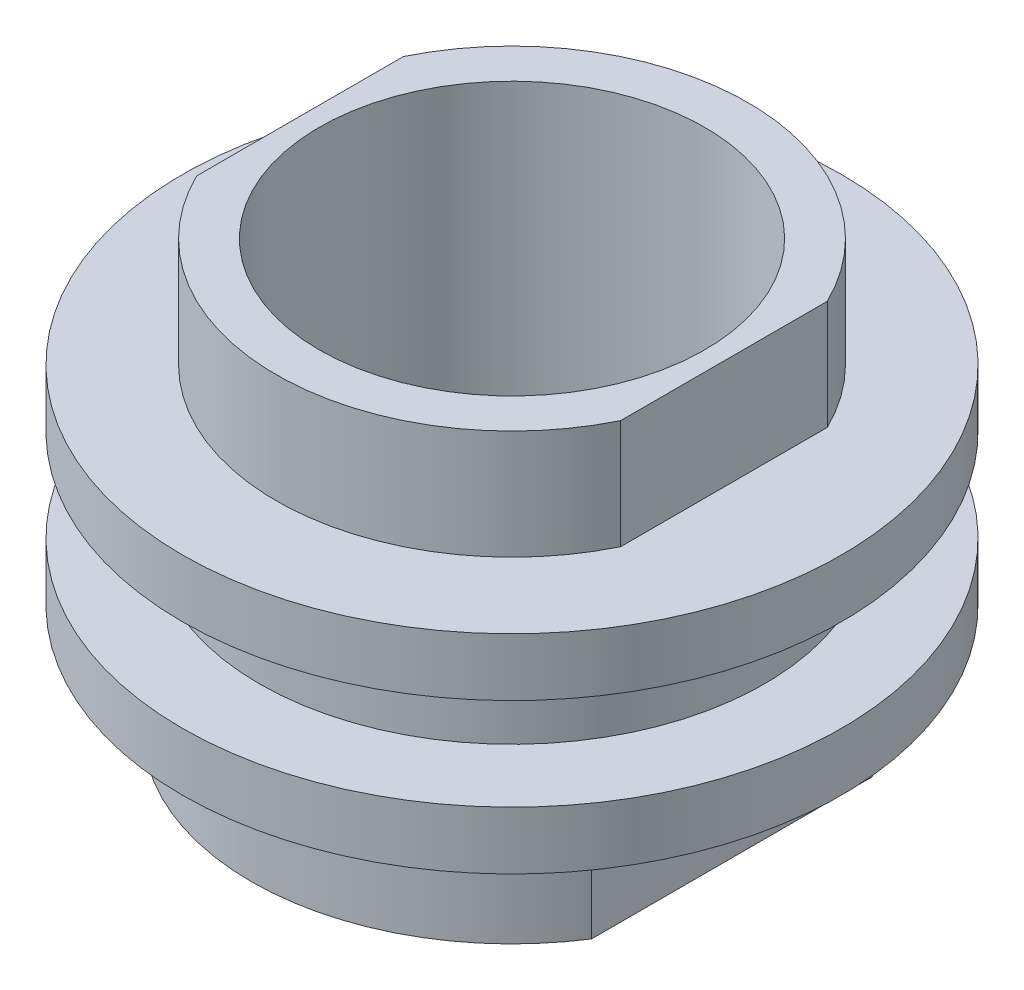
ISO-10303-21;
HEADER;
FILE_DESCRIPTION(('STEP AP214'),'2;1');
FILE_NAME('part.step','',(''),(''),'','','');
FILE_SCHEMA(('AUTOMOTIVE_DESIGN { 1 0 10303 214 1 1 1 1 }'));
ENDSEC;
DATA;
#1=APPLICATION_CONTEXT('core data for automotive mechanical design processes');
#2=APPLICATION_PROTOCOL_DEFINITION('international standard','automotive_design',2000,#1);
#3=PRODUCT_CONTEXT('',#1,'mechanical');
#4=PRODUCT('Part','Part','',(#3));
#5=PRODUCT_RELATED_PRODUCT_CATEGORY('part','',(#4));
#6=PRODUCT_DEFINITION_FORMATION('','',#4);
#7=PRODUCT_DEFINITION_CONTEXT('part definition',#1,'design');
#8=PRODUCT_DEFINITION('design','',#6,#7);
#9=PRODUCT_DEFINITION_SHAPE('','',#8);
#10=(LENGTH_UNIT() NAMED_UNIT(*) SI_UNIT(.MILLI.,.METRE.));
#11=(NAMED_UNIT(*) PLANE_ANGLE_UNIT() SI_UNIT($,.RADIAN.));
#12=(NAMED_UNIT(*) SI_UNIT($,.STERADIAN.) SOLID_ANGLE_UNIT());
#13=UNCERTAINTY_MEASURE_WITH_UNIT(LENGTH_MEASURE(1.E-05),#10,'distance_accuracy_value','');
#14=(GEOMETRIC_REPRESENTATION_CONTEXT(3) GLOBAL_UNCERTAINTY_ASSIGNED_CONTEXT((#13)) GLOBAL_UNIT_ASSIGNED_CONTEXT((#10,
#11,#12)) REPRESENTATION_CONTEXT('',''));
#15=CARTESIAN_POINT('',(0.,0.,0.));
#16=DIRECTION('',(0.,0.,1.));
#17=DIRECTION('',(1.,0.,0.));
#18=AXIS2_PLACEMENT_3D('',#15,#16,#17);
#19=CARTESIAN_POINT('',(0.,0.844999999999992,0.));
#20=DIRECTION('',(0.,-1.,0.));
#21=DIRECTION('',(0.,0.,-1.));
#22=AXIS2_PLACEMENT_3D('',#19,#20,#21);
#23=CYLINDRICAL_SURFACE('',#22,4.625);
#24=CARTESIAN_POINT('',(0.,0.844999999999992,0.));
#25=DIRECTION('',(0.,1.,0.));
#26=DIRECTION('',(0.,0.,1.));
#27=AXIS2_PLACEMENT_3D('',#24,#25,#26);
#28=CIRCLE('',#27,4.625);
#29=CARTESIAN_POINT('',(0.,0.844999999999992,4.62500000000002));
#30=VERTEX_POINT('',#29);
#31=EDGE_CURVE('E11',#30,#30,#28,.T.);
#32=ORIENTED_EDGE('',*,*,#31,.F.);
#33=EDGE_LOOP('',(#32));
#34=FACE_BOUND('',#33,.T.);
#35=CARTESIAN_POINT('',(0.,-0.844999999999999,0.));
#36=DIRECTION('',(0.,1.,0.));
#37=DIRECTION('',(0.,0.,1.));
#38=AXIS2_PLACEMENT_3D('',#35,#36,#37);
#39=CIRCLE('',#38,4.625);
#40=CARTESIAN_POINT('',(0.,-0.844999999999999,4.625));
#41=VERTEX_POINT('',#40);
#42=EDGE_CURVE('E45',#41,#41,#39,.T.);
#43=ORIENTED_EDGE('',*,*,#42,.T.);
#44=EDGE_LOOP('',(#43));
#45=FACE_BOUND('',#44,.T.);
#46=ADVANCED_FACE('F42',(#34,#45),#23,.T.);
#47=CARTESIAN_POINT('',(0.,1.90499999999999,0.));
#48=DIRECTION('',(0.,-1.,0.));
#49=DIRECTION('',(0.,0.,-1.));
#50=AXIS2_PLACEMENT_3D('',#47,#48,#49);
#51=CYLINDRICAL_SURFACE('',#50,6.035);
#52=CARTESIAN_POINT('',(0.,1.90499999999999,0.));
#53=DIRECTION('',(0.,1.,0.));
#54=DIRECTION('',(0.,0.,1.));
#55=AXIS2_PLACEMENT_3D('',#52,#53,#54);
#56=CIRCLE('',#55,6.035);
#57=CARTESIAN_POINT('',(0.,1.90499999999999,6.035));
#58=VERTEX_POINT('',#57);
#59=EDGE_CURVE('E51',#58,#58,#56,.T.);
#60=ORIENTED_EDGE('',*,*,#59,.F.);
#61=EDGE_LOOP('',(#60));
#62=FACE_BOUND('',#61,.T.);
#63=CARTESIAN_POINT('',(0.,0.844999999999992,0.));
#64=DIRECTION('',(0.,1.,0.));
#65=DIRECTION('',(0.,0.,1.));
#66=AXIS2_PLACEMENT_3D('',#63,#64,#65);
#67=CIRCLE('',#66,6.035);
#68=CARTESIAN_POINT('',(0.,0.844999999999992,6.03500000000003));
#69=VERTEX_POINT('',#68);
#70=EDGE_CURVE('E195',#69,#69,#67,.T.);
#71=ORIENTED_EDGE('',*,*,#70,.T.);
#72=EDGE_LOOP('',(#71));
#73=FACE_BOUND('',#72,.T.);
#74=ADVANCED_FACE('F231',(#62,#73),#51,.T.);
#75=CARTESIAN_POINT('',(0.,1.90499999999999,0.));
#76=DIRECTION('',(0.,1.,0.));
#77=DIRECTION('',(0.,0.,1.));
#78=AXIS2_PLACEMENT_3D('',#75,#76,#77);
#79=PLANE('',#78);
#80=DIRECTION('',(0.,0.,-1.));
#81=VECTOR('',#80,1.);
#82=CARTESIAN_POINT('',(3.88134831460675,1.905,0.));
#83=LINE('',#82,#81);
#84=CARTESIAN_POINT('',(3.88134831460676,1.90500000000001,1.89215730337078));
#85=VERTEX_POINT('',#84);
#86=CARTESIAN_POINT('',(3.88134831460675,1.905,-1.89215730337078));
#87=VERTEX_POINT('',#86);
#88=EDGE_CURVE('E132',#85,#87,#83,.T.);
#89=ORIENTED_EDGE('',*,*,#88,.F.);
#90=CARTESIAN_POINT('',(0.,1.90499999999999,0.));
#91=DIRECTION('',(0.,1.,0.));
#92=DIRECTION('',(0.,0.,1.));
#93=AXIS2_PLACEMENT_3D('',#90,#91,#92);
#94=CIRCLE('',#93,4.318);
#95=CARTESIAN_POINT('',(-3.88134831460673,1.90499999999998,1.89215730337078));
#96=VERTEX_POINT('',#95);
#97=EDGE_CURVE('E149',#96,#85,#94,.T.);
#98=ORIENTED_EDGE('',*,*,#97,.F.);
#99=DIRECTION('',(0.,0.,-1.));
#100=VECTOR('',#99,1.);
#101=CARTESIAN_POINT('',(-3.88134831460674,1.905,0.));
#102=LINE('',#101,#100);
#103=CARTESIAN_POINT('',(-3.88134831460673,1.90499999999999,-1.89215730337075));
#104=VERTEX_POINT('',#103);
#105=EDGE_CURVE('E163',#96,#104,#102,.T.);
#106=ORIENTED_EDGE('',*,*,#105,.T.);
#107=CARTESIAN_POINT('',(0.,1.90499999999999,0.));
#108=DIRECTION('',(0.,1.,0.));
#109=DIRECTION('',(0.,0.,1.));
#110=AXIS2_PLACEMENT_3D('',#107,#108,#109);
#111=CIRCLE('',#110,4.318);
#112=EDGE_CURVE('E138',#87,#104,#111,.T.);
#113=ORIENTED_EDGE('',*,*,#112,.F.);
#114=EDGE_LOOP('',(#89,#98,#106,#113));
#115=FACE_BOUND('',#114,.T.);
#116=ORIENTED_EDGE('',*,*,#59,.T.);
#117=EDGE_LOOP('',(#116));
#118=FACE_BOUND('',#117,.T.);
#119=ADVANCED_FACE('F225',(#115,#118),#79,.T.);
#120=CARTESIAN_POINT('',(0.,0.844999999999992,0.));
#121=DIRECTION('',(0.,1.,0.));
#122=DIRECTION('',(0.,0.,1.));
#123=AXIS2_PLACEMENT_3D('',#120,#121,#122);
#124=PLANE('',#123);
#125=ORIENTED_EDGE('',*,*,#31,.T.);
#126=EDGE_LOOP('',(#125));
#127=FACE_BOUND('',#126,.T.);
#128=ORIENTED_EDGE('',*,*,#70,.F.);
#129=EDGE_LOOP('',(#128));
#130=FACE_BOUND('',#129,.T.);
#131=ADVANCED_FACE('F217',(#127,#130),#124,.F.);
#132=CARTESIAN_POINT('',(0.,-1.90499999999999,0.));
#133=DIRECTION('',(0.,1.,0.));
#134=DIRECTION('',(0.,0.,1.));
#135=AXIS2_PLACEMENT_3D('',#132,#133,#134);
#136=CYLINDRICAL_SURFACE('',#135,6.035);
#137=CARTESIAN_POINT('',(0.,-1.90499999999999,0.));
#138=DIRECTION('',(0.,-1.,0.));
#139=DIRECTION('',(0.,0.,-1.));
#140=AXIS2_PLACEMENT_3D('',#137,#138,#139);
#141=CIRCLE('',#140,6.035);
#142=CARTESIAN_POINT('',(0.,-1.90499999999999,-6.03499999999997));
#143=VERTEX_POINT('',#142);
#144=EDGE_CURVE('E185',#143,#143,#141,.T.);
#145=ORIENTED_EDGE('',*,*,#144,.F.);
#146=EDGE_LOOP('',(#145));
#147=FACE_BOUND('',#146,.T.);
#148=CARTESIAN_POINT('',(0.,-0.844999999999999,0.));
#149=DIRECTION('',(0.,-1.,0.));
#150=DIRECTION('',(0.,0.,-1.));
#151=AXIS2_PLACEMENT_3D('',#148,#149,#150);
#152=CIRCLE('',#151,6.035);
#153=CARTESIAN_POINT('',(0.,-0.844999999999999,-6.035));
#154=VERTEX_POINT('',#153);
#155=EDGE_CURVE('E184',#154,#154,#152,.T.);
#156=ORIENTED_EDGE('',*,*,#155,.T.);
#157=EDGE_LOOP('',(#156));
#158=FACE_BOUND('',#157,.T.);
#159=ADVANCED_FACE('F215',(#147,#158),#136,.T.);
#160=CARTESIAN_POINT('',(0.,-1.90499999999999,0.));
#161=DIRECTION('',(0.,-1.,0.));
#162=DIRECTION('',(0.,0.,-1.));
#163=AXIS2_PLACEMENT_3D('',#160,#161,#162);
#164=PLANE('',#163);
#165=DIRECTION('',(0.,0.,1.));
#166=VECTOR('',#165,1.);
#167=CARTESIAN_POINT('',(4.02481142857144,-1.90500000000001,0.));
#168=LINE('',#167,#166);
#169=CARTESIAN_POINT('',(4.02481142857143,-1.905,-2.56971360358327));
#170=VERTEX_POINT('',#169);
#171=CARTESIAN_POINT('',(4.02481142857144,-1.905,2.56971360358327));
#172=VERTEX_POINT('',#171);
#173=EDGE_CURVE('E58',#170,#172,#168,.T.);
#174=ORIENTED_EDGE('',*,*,#173,.F.);
#175=CARTESIAN_POINT('',(0.,-1.90499999999999,0.));
#176=DIRECTION('',(0.,-1.,0.));
#177=DIRECTION('',(0.,0.,-1.));
#178=AXIS2_PLACEMENT_3D('',#175,#176,#177);
#179=CIRCLE('',#178,4.7752);
#180=CARTESIAN_POINT('',(-4.02481142857142,-1.90499999999999,-2.56971360358324));
#181=VERTEX_POINT('',#180);
#182=EDGE_CURVE('E62',#181,#170,#179,.T.);
#183=ORIENTED_EDGE('',*,*,#182,.F.);
#184=DIRECTION('',(0.,0.,1.));
#185=VECTOR('',#184,1.);
#186=CARTESIAN_POINT('',(-4.0248114285714,-1.90500000000001,0.));
#187=LINE('',#186,#185);
#188=CARTESIAN_POINT('',(-4.02481142857142,-1.905,2.56971360358327));
#189=VERTEX_POINT('',#188);
#190=EDGE_CURVE('E320',#181,#189,#187,.T.);
#191=ORIENTED_EDGE('',*,*,#190,.T.);
#192=CARTESIAN_POINT('',(0.,-1.90499999999999,0.));
#193=DIRECTION('',(0.,-1.,0.));
#194=DIRECTION('',(0.,0.,-1.));
#195=AXIS2_PLACEMENT_3D('',#192,#193,#194);
#196=CIRCLE('',#195,4.7752);
#197=EDGE_CURVE('E317',#172,#189,#196,.T.);
#198=ORIENTED_EDGE('',*,*,#197,.F.);
#199=EDGE_LOOP('',(#174,#183,#191,#198));
#200=FACE_BOUND('',#199,.T.);
#201=ORIENTED_EDGE('',*,*,#144,.T.);
#202=EDGE_LOOP('',(#201));
#203=FACE_BOUND('',#202,.T.);
#204=ADVANCED_FACE('F211',(#200,#203),#164,.T.);
#205=CARTESIAN_POINT('',(0.,-0.844999999999999,0.));
#206=DIRECTION('',(0.,-1.,0.));
#207=DIRECTION('',(0.,0.,-1.));
#208=AXIS2_PLACEMENT_3D('',#205,#206,#207);
#209=PLANE('',#208);
#210=ORIENTED_EDGE('',*,*,#42,.F.);
#211=EDGE_LOOP('',(#210));
#212=FACE_BOUND('',#211,.T.);
#213=ORIENTED_EDGE('',*,*,#155,.F.);
#214=EDGE_LOOP('',(#213));
#215=FACE_BOUND('',#214,.T.);
#216=ADVANCED_FACE('F207',(#212,#215),#209,.F.);
#217=CARTESIAN_POINT('',(3.88134831460676,3.90499999999998,0.));
#218=DIRECTION('',(-1.,0.,0.));
#219=DIRECTION('',(0.,0.,1.));
#220=AXIS2_PLACEMENT_3D('',#217,#218,#219);
#221=PLANE('',#220);
#222=ORIENTED_EDGE('',*,*,#88,.T.);
#223=DIRECTION('',(0.,-1.,0.));
#224=VECTOR('',#223,1.);
#225=CARTESIAN_POINT('',(3.88134831460676,3.905,-1.89215730337081));
#226=LINE('',#225,#224);
#227=CARTESIAN_POINT('',(3.88134831460676,3.905,-1.89215730337081));
#228=VERTEX_POINT('',#227);
#229=EDGE_CURVE('E180',#228,#87,#226,.T.);
#230=ORIENTED_EDGE('',*,*,#229,.F.);
#231=DIRECTION('',(0.,0.,-1.));
#232=VECTOR('',#231,1.);
#233=CARTESIAN_POINT('',(3.88134831460676,3.90499999999998,0.));
#234=LINE('',#233,#232);
#235=CARTESIAN_POINT('',(3.88134831460674,3.90499999999999,1.89215730337081));
#236=VERTEX_POINT('',#235);
#237=EDGE_CURVE('E144',#236,#228,#234,.T.);
#238=ORIENTED_EDGE('',*,*,#237,.F.);
#239=DIRECTION('',(0.,-1.,0.));
#240=VECTOR('',#239,1.);
#241=CARTESIAN_POINT('',(3.88134831460674,3.90499999999999,1.89215730337081));
#242=LINE('',#241,#240);
#243=EDGE_CURVE('E158',#236,#85,#242,.T.);
#244=ORIENTED_EDGE('',*,*,#243,.T.);
#245=EDGE_LOOP('',(#222,#230,#238,#244));
#246=FACE_BOUND('',#245,.T.);
#247=ADVANCED_FACE('F210',(#246),#221,.F.);
#248=CARTESIAN_POINT('',(0.,3.905,0.));
#249=DIRECTION('',(0.,-1.,0.));
#250=DIRECTION('',(0.,0.,-1.));
#251=AXIS2_PLACEMENT_3D('',#248,#249,#250);
#252=CYLINDRICAL_SURFACE('',#251,4.318);
#253=ORIENTED_EDGE('',*,*,#112,.T.);
#254=DIRECTION('',(0.,-1.,0.));
#255=VECTOR('',#254,1.);
#256=CARTESIAN_POINT('',(-3.88134831460672,3.90499999999999,-1.89215730337075));
#257=LINE('',#256,#255);
#258=CARTESIAN_POINT('',(-3.88134831460672,3.90499999999999,-1.89215730337075));
#259=VERTEX_POINT('',#258);
#260=EDGE_CURVE('E176',#259,#104,#257,.T.);
#261=ORIENTED_EDGE('',*,*,#260,.F.);
#262=CARTESIAN_POINT('',(0.,3.905,0.));
#263=DIRECTION('',(0.,1.,0.));
#264=DIRECTION('',(0.,0.,1.));
#265=AXIS2_PLACEMENT_3D('',#262,#263,#264);
#266=CIRCLE('',#265,4.318);
#267=EDGE_CURVE('E148',#228,#259,#266,.T.);
#268=ORIENTED_EDGE('',*,*,#267,.F.);
#269=ORIENTED_EDGE('',*,*,#229,.T.);
#270=EDGE_LOOP('',(#253,#261,#268,#269));
#271=FACE_BOUND('',#270,.T.);
#272=ADVANCED_FACE('F262',(#271),#252,.T.);
#273=CARTESIAN_POINT('',(-3.88134831460674,3.905,0.));
#274=DIRECTION('',(-1.,0.,0.));
#275=DIRECTION('',(0.,0.,1.));
#276=AXIS2_PLACEMENT_3D('',#273,#274,#275);
#277=PLANE('',#276);
#278=ORIENTED_EDGE('',*,*,#105,.F.);
#279=DIRECTION('',(0.,-1.,0.));
#280=VECTOR('',#279,1.);
#281=CARTESIAN_POINT('',(-3.88134831460674,3.90500000000001,1.89215730337081));
#282=LINE('',#281,#280);
#283=CARTESIAN_POINT('',(-3.88134831460674,3.90500000000001,1.89215730337081));
#284=VERTEX_POINT('',#283);
#285=EDGE_CURVE('E172',#284,#96,#282,.T.);
#286=ORIENTED_EDGE('',*,*,#285,.F.);
#287=DIRECTION('',(0.,0.,-1.));
#288=VECTOR('',#287,1.);
#289=CARTESIAN_POINT('',(-3.88134831460674,3.905,0.));
#290=LINE('',#289,#288);
#291=EDGE_CURVE('E152',#284,#259,#290,.T.);
#292=ORIENTED_EDGE('',*,*,#291,.T.);
#293=ORIENTED_EDGE('',*,*,#260,.T.);
#294=EDGE_LOOP('',(#278,#286,#292,#293));
#295=FACE_BOUND('',#294,.T.);
#296=ADVANCED_FACE('F260',(#295),#277,.T.);
#297=CARTESIAN_POINT('',(0.,3.905,0.));
#298=DIRECTION('',(0.,-1.,0.));
#299=DIRECTION('',(0.,0.,-1.));
#300=AXIS2_PLACEMENT_3D('',#297,#298,#299);
#301=CYLINDRICAL_SURFACE('',#300,4.318);
#302=ORIENTED_EDGE('',*,*,#97,.T.);
#303=ORIENTED_EDGE('',*,*,#243,.F.);
#304=CARTESIAN_POINT('',(0.,3.905,0.));
#305=DIRECTION('',(0.,1.,0.));
#306=DIRECTION('',(0.,0.,1.));
#307=AXIS2_PLACEMENT_3D('',#304,#305,#306);
#308=CIRCLE('',#307,4.318);
#309=EDGE_CURVE('E156',#284,#236,#308,.T.);
#310=ORIENTED_EDGE('',*,*,#309,.F.);
#311=ORIENTED_EDGE('',*,*,#285,.T.);
#312=EDGE_LOOP('',(#302,#303,#310,#311));
#313=FACE_BOUND('',#312,.T.);
#314=ADVANCED_FACE('F251',(#313),#301,.T.);
#315=CARTESIAN_POINT('',(0.,3.905,0.));
#316=DIRECTION('',(0.,1.,0.));
#317=DIRECTION('',(0.,0.,1.));
#318=AXIS2_PLACEMENT_3D('',#315,#316,#317);
#319=PLANE('',#318);
#320=CARTESIAN_POINT('',(0.,3.905,0.));
#321=DIRECTION('',(0.,1.,0.));
#322=DIRECTION('',(0.,0.,1.));
#323=AXIS2_PLACEMENT_3D('',#320,#321,#322);
#324=CIRCLE('',#323,3.5306);
#325=CARTESIAN_POINT('',(0.,3.905,3.5306));
#326=VERTEX_POINT('',#325);
#327=EDGE_CURVE('E303',#326,#326,#324,.T.);
#328=ORIENTED_EDGE('',*,*,#327,.F.);
#329=EDGE_LOOP('',(#328));
#330=FACE_BOUND('',#329,.T.);
#331=ORIENTED_EDGE('',*,*,#237,.T.);
#332=ORIENTED_EDGE('',*,*,#267,.T.);
#333=ORIENTED_EDGE('',*,*,#291,.F.);
#334=ORIENTED_EDGE('',*,*,#309,.T.);
#335=EDGE_LOOP('',(#331,#332,#333,#334));
#336=FACE_BOUND('',#335,.T.);
#337=ADVANCED_FACE('F256',(#330,#336),#319,.T.);
#338=CARTESIAN_POINT('',(4.02481142857145,-3.90500000000001,0.));
#339=DIRECTION('',(-1.,0.,0.));
#340=DIRECTION('',(0.,0.,1.));
#341=AXIS2_PLACEMENT_3D('',#338,#339,#340);
#342=PLANE('',#341);
#343=ORIENTED_EDGE('',*,*,#173,.T.);
#344=DIRECTION('',(0.,1.,0.));
#345=VECTOR('',#344,1.);
#346=CARTESIAN_POINT('',(4.02481142857144,-3.905,2.56971360358327));
#347=LINE('',#346,#345);
#348=CARTESIAN_POINT('',(4.02481142857144,-3.905,2.56971360358327));
#349=VERTEX_POINT('',#348);
#350=EDGE_CURVE('E111',#349,#172,#347,.T.);
#351=ORIENTED_EDGE('',*,*,#350,.F.);
#352=DIRECTION('',(0.,0.,1.));
#353=VECTOR('',#352,1.);
#354=CARTESIAN_POINT('',(4.02481142857145,-3.90500000000001,0.));
#355=LINE('',#354,#353);
#356=CARTESIAN_POINT('',(4.02481142857142,-3.90499999999999,-2.56971360358327));
#357=VERTEX_POINT('',#356);
#358=EDGE_CURVE('E119',#357,#349,#355,.T.);
#359=ORIENTED_EDGE('',*,*,#358,.F.);
#360=DIRECTION('',(0.,1.,0.));
#361=VECTOR('',#360,1.);
#362=CARTESIAN_POINT('',(4.02481142857142,-3.90499999999999,-2.56971360358327));
#363=LINE('',#362,#361);
#364=EDGE_CURVE('E314',#357,#170,#363,.T.);
#365=ORIENTED_EDGE('',*,*,#364,.T.);
#366=EDGE_LOOP('',(#343,#351,#359,#365));
#367=FACE_BOUND('',#366,.T.);
#368=ADVANCED_FACE('F130',(#367),#342,.F.);
#369=CARTESIAN_POINT('',(0.,-3.90500000000001,0.));
#370=DIRECTION('',(0.,1.,0.));
#371=DIRECTION('',(0.,0.,1.));
#372=AXIS2_PLACEMENT_3D('',#369,#370,#371);
#373=CYLINDRICAL_SURFACE('',#372,4.7752);
#374=ORIENTED_EDGE('',*,*,#197,.T.);
#375=DIRECTION('',(0.,1.,0.));
#376=VECTOR('',#375,1.);
#377=CARTESIAN_POINT('',(-4.02481142857142,-3.90500000000001,2.56971360358327));
#378=LINE('',#377,#376);
#379=CARTESIAN_POINT('',(-4.02481142857142,-3.90500000000001,2.56971360358327));
#380=VERTEX_POINT('',#379);
#381=EDGE_CURVE('E113',#380,#189,#378,.T.);
#382=ORIENTED_EDGE('',*,*,#381,.F.);
#383=CARTESIAN_POINT('',(0.,-3.90500000000001,0.));
#384=DIRECTION('',(0.,-1.,0.));
#385=DIRECTION('',(0.,0.,-1.));
#386=AXIS2_PLACEMENT_3D('',#383,#384,#385);
#387=CIRCLE('',#386,4.7752);
#388=EDGE_CURVE('E106',#349,#380,#387,.T.);
#389=ORIENTED_EDGE('',*,*,#388,.F.);
#390=ORIENTED_EDGE('',*,*,#350,.T.);
#391=EDGE_LOOP('',(#374,#382,#389,#390));
#392=FACE_BOUND('',#391,.T.);
#393=ADVANCED_FACE('F109',(#392),#373,.T.);
#394=CARTESIAN_POINT('',(-4.02481142857142,-3.90500000000001,0.));
#395=DIRECTION('',(-1.,0.,0.));
#396=DIRECTION('',(0.,0.,1.));
#397=AXIS2_PLACEMENT_3D('',#394,#395,#396);
#398=PLANE('',#397);
#399=ORIENTED_EDGE('',*,*,#190,.F.);
#400=DIRECTION('',(0.,1.,0.));
#401=VECTOR('',#400,1.);
#402=CARTESIAN_POINT('',(-4.02481142857141,-3.905,-2.56971360358321));
#403=LINE('',#402,#401);
#404=CARTESIAN_POINT('',(-4.02481142857141,-3.905,-2.56971360358321));
#405=VERTEX_POINT('',#404);
#406=EDGE_CURVE('E140',#405,#181,#403,.T.);
#407=ORIENTED_EDGE('',*,*,#406,.F.);
#408=DIRECTION('',(0.,0.,1.));
#409=VECTOR('',#408,1.);
#410=CARTESIAN_POINT('',(-4.02481142857142,-3.90500000000001,0.));
#411=LINE('',#410,#409);
#412=EDGE_CURVE('E118',#405,#380,#411,.T.);
#413=ORIENTED_EDGE('',*,*,#412,.T.);
#414=ORIENTED_EDGE('',*,*,#381,.T.);
#415=EDGE_LOOP('',(#399,#407,#413,#414));
#416=FACE_BOUND('',#415,.T.);
#417=ADVANCED_FACE('F281',(#416),#398,.T.);
#418=CARTESIAN_POINT('',(0.,-3.90500000000001,0.));
#419=DIRECTION('',(0.,1.,0.));
#420=DIRECTION('',(0.,0.,1.));
#421=AXIS2_PLACEMENT_3D('',#418,#419,#420);
#422=CYLINDRICAL_SURFACE('',#421,4.7752);
#423=ORIENTED_EDGE('',*,*,#182,.T.);
#424=ORIENTED_EDGE('',*,*,#364,.F.);
#425=CARTESIAN_POINT('',(0.,-3.90500000000001,0.));
#426=DIRECTION('',(0.,-1.,0.));
#427=DIRECTION('',(0.,0.,-1.));
#428=AXIS2_PLACEMENT_3D('',#425,#426,#427);
#429=CIRCLE('',#428,4.7752);
#430=EDGE_CURVE('E124',#405,#357,#429,.T.);
#431=ORIENTED_EDGE('',*,*,#430,.F.);
#432=ORIENTED_EDGE('',*,*,#406,.T.);
#433=EDGE_LOOP('',(#423,#424,#431,#432));
#434=FACE_BOUND('',#433,.T.);
#435=ADVANCED_FACE('F284',(#434),#422,.T.);
#436=CARTESIAN_POINT('',(0.,-3.90500000000001,0.));
#437=DIRECTION('',(0.,-1.,0.));
#438=DIRECTION('',(0.,0.,-1.));
#439=AXIS2_PLACEMENT_3D('',#436,#437,#438);
#440=PLANE('',#439);
#441=CARTESIAN_POINT('',(0.,-3.90500000000001,0.));
#442=DIRECTION('',(0.,1.,0.));
#443=DIRECTION('',(0.,0.,1.));
#444=AXIS2_PLACEMENT_3D('',#441,#442,#443);
#445=CIRCLE('',#444,3.5306);
#446=CARTESIAN_POINT('',(0.,-3.90500000000001,3.5306));
#447=VERTEX_POINT('',#446);
#448=EDGE_CURVE('E300',#447,#447,#445,.T.);
#449=ORIENTED_EDGE('',*,*,#448,.T.);
#450=EDGE_LOOP('',(#449));
#451=FACE_BOUND('',#450,.T.);
#452=ORIENTED_EDGE('',*,*,#358,.T.);
#453=ORIENTED_EDGE('',*,*,#388,.T.);
#454=ORIENTED_EDGE('',*,*,#412,.F.);
#455=ORIENTED_EDGE('',*,*,#430,.T.);
#456=EDGE_LOOP('',(#452,#453,#454,#455));
#457=FACE_BOUND('',#456,.T.);
#458=ADVANCED_FACE('F122',(#451,#457),#440,.T.);
#459=CARTESIAN_POINT('',(0.,-3.90500000000001,0.));
#460=DIRECTION('',(0.,1.,0.));
#461=DIRECTION('',(0.,0.,1.));
#462=AXIS2_PLACEMENT_3D('',#459,#460,#461);
#463=CYLINDRICAL_SURFACE('',#462,3.5306);
#464=ORIENTED_EDGE('',*,*,#448,.F.);
#465=EDGE_LOOP('',(#464));
#466=FACE_BOUND('',#465,.T.);
#467=ORIENTED_EDGE('',*,*,#327,.T.);
#468=EDGE_LOOP('',(#467));
#469=FACE_BOUND('',#468,.T.);
#470=ADVANCED_FACE('F291',(#466,#469),#463,.F.);
#471=CLOSED_SHELL('',(#46,#74,#119,#131,#159,#204,#216,#247,#272,#296,#314,#337,#368,#393,#417,
#435,#458,#470));
#472=MANIFOLD_SOLID_BREP('B2',#471);
#473=ADVANCED_BREP_SHAPE_REPRESENTATION('',(#18,#472),#14);
#474=SHAPE_DEFINITION_REPRESENTATION(#9,#473);
ENDSEC;
END-ISO-10303-21;
